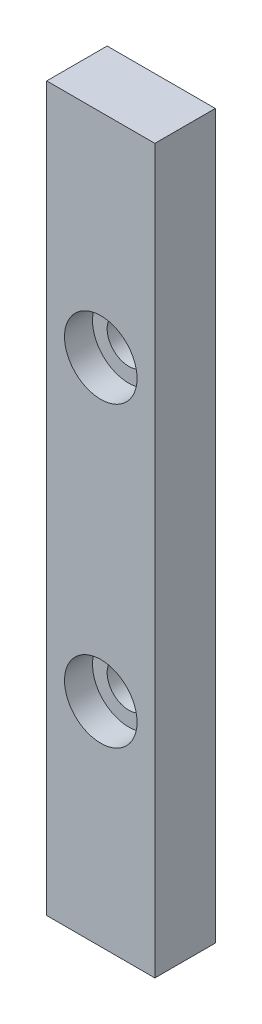
ISO-10303-21;
HEADER;
FILE_DESCRIPTION(('STEP AP214'),'2;1');
FILE_NAME('part.step','',(''),(''),'','','');
FILE_SCHEMA(('AUTOMOTIVE_DESIGN { 1 0 10303 214 1 1 1 1 }'));
ENDSEC;
DATA;
#1=APPLICATION_CONTEXT('core data for automotive mechanical design processes');
#2=APPLICATION_PROTOCOL_DEFINITION('international standard','automotive_design',2000,#1);
#3=PRODUCT_CONTEXT('',#1,'mechanical');
#4=PRODUCT('Part','Part','',(#3));
#5=PRODUCT_RELATED_PRODUCT_CATEGORY('part','',(#4));
#6=PRODUCT_DEFINITION_FORMATION('','',#4);
#7=PRODUCT_DEFINITION_CONTEXT('part definition',#1,'design');
#8=PRODUCT_DEFINITION('design','',#6,#7);
#9=PRODUCT_DEFINITION_SHAPE('','',#8);
#10=(LENGTH_UNIT() NAMED_UNIT(*) SI_UNIT(.MILLI.,.METRE.));
#11=(NAMED_UNIT(*) PLANE_ANGLE_UNIT() SI_UNIT($,.RADIAN.));
#12=(NAMED_UNIT(*) SI_UNIT($,.STERADIAN.) SOLID_ANGLE_UNIT());
#13=UNCERTAINTY_MEASURE_WITH_UNIT(LENGTH_MEASURE(1.E-05),#10,'distance_accuracy_value','');
#14=(GEOMETRIC_REPRESENTATION_CONTEXT(3) GLOBAL_UNCERTAINTY_ASSIGNED_CONTEXT((#13)) GLOBAL_UNIT_ASSIGNED_CONTEXT((#10,
#11,#12)) REPRESENTATION_CONTEXT('',''));
#15=CARTESIAN_POINT('',(0.,0.,0.));
#16=DIRECTION('',(0.,0.,1.));
#17=DIRECTION('',(1.,0.,0.));
#18=AXIS2_PLACEMENT_3D('',#15,#16,#17);
#19=CARTESIAN_POINT('',(4.25,-40.1,4.75));
#20=DIRECTION('',(0.,0.,1.));
#21=DIRECTION('',(1.,0.,0.));
#22=AXIS2_PLACEMENT_3D('',#19,#20,#21);
#23=CYLINDRICAL_SURFACE('',#22,1.69999999999999);
#24=CARTESIAN_POINT('',(4.25,-40.1,0.));
#25=DIRECTION('',(0.,0.,1.));
#26=DIRECTION('',(1.,0.,0.));
#27=AXIS2_PLACEMENT_3D('',#24,#25,#26);
#28=CIRCLE('',#27,1.69999999999999);
#29=CARTESIAN_POINT('',(5.94999999999999,-40.1,0.));
#30=VERTEX_POINT('',#29);
#31=EDGE_CURVE('E106',#30,#30,#28,.T.);
#32=ORIENTED_EDGE('',*,*,#31,.F.);
#33=EDGE_LOOP('',(#32));
#34=FACE_BOUND('',#33,.T.);
#35=CARTESIAN_POINT('',(4.25,-40.1,2.55));
#36=DIRECTION('',(0.,0.,1.));
#37=DIRECTION('',(1.,0.,0.));
#38=AXIS2_PLACEMENT_3D('',#35,#36,#37);
#39=CIRCLE('',#38,1.69999999999999);
#40=CARTESIAN_POINT('',(5.94999999999999,-40.1,2.55));
#41=VERTEX_POINT('',#40);
#42=EDGE_CURVE('E40',#41,#41,#39,.F.);
#43=ORIENTED_EDGE('',*,*,#42,.F.);
#44=EDGE_LOOP('',(#43));
#45=FACE_BOUND('',#44,.T.);
#46=ADVANCED_FACE('F36',(#34,#45),#23,.F.);
#47=CARTESIAN_POINT('',(4.25,-16.7,4.75));
#48=DIRECTION('',(0.,0.,1.));
#49=DIRECTION('',(1.,0.,0.));
#50=AXIS2_PLACEMENT_3D('',#47,#48,#49);
#51=CYLINDRICAL_SURFACE('',#50,1.69999999999999);
#52=CARTESIAN_POINT('',(4.25,-16.7,0.));
#53=DIRECTION('',(0.,0.,1.));
#54=DIRECTION('',(1.,0.,0.));
#55=AXIS2_PLACEMENT_3D('',#52,#53,#54);
#56=CIRCLE('',#55,1.69999999999999);
#57=CARTESIAN_POINT('',(5.94999999999999,-16.7,0.));
#58=VERTEX_POINT('',#57);
#59=EDGE_CURVE('E112',#58,#58,#56,.T.);
#60=ORIENTED_EDGE('',*,*,#59,.F.);
#61=EDGE_LOOP('',(#60));
#62=FACE_BOUND('',#61,.T.);
#63=CARTESIAN_POINT('',(4.25,-16.7,2.55));
#64=DIRECTION('',(0.,0.,1.));
#65=DIRECTION('',(1.,0.,0.));
#66=AXIS2_PLACEMENT_3D('',#63,#64,#65);
#67=CIRCLE('',#66,1.69999999999999);
#68=CARTESIAN_POINT('',(5.94999999999999,-16.7,2.55));
#69=VERTEX_POINT('',#68);
#70=EDGE_CURVE('E114',#69,#69,#67,.F.);
#71=ORIENTED_EDGE('',*,*,#70,.F.);
#72=EDGE_LOOP('',(#71));
#73=FACE_BOUND('',#72,.T.);
#74=ADVANCED_FACE('F142',(#62,#73),#51,.F.);
#75=CARTESIAN_POINT('',(0.,0.,4.75));
#76=DIRECTION('',(1.,0.,0.));
#77=DIRECTION('',(0.,1.,0.));
#78=AXIS2_PLACEMENT_3D('',#75,#76,#77);
#79=PLANE('',#78);
#80=DIRECTION('',(0.,-1.,0.));
#81=VECTOR('',#80,1.);
#82=CARTESIAN_POINT('',(0.,0.,0.));
#83=LINE('',#82,#81);
#84=CARTESIAN_POINT('',(0.,0.,0.));
#85=VERTEX_POINT('',#84);
#86=CARTESIAN_POINT('',(0.,-56.8,0.));
#87=VERTEX_POINT('',#86);
#88=EDGE_CURVE('E103',#85,#87,#83,.T.);
#89=ORIENTED_EDGE('',*,*,#88,.T.);
#90=DIRECTION('',(0.,0.,-1.));
#91=VECTOR('',#90,1.);
#92=CARTESIAN_POINT('',(0.,-56.8,4.75));
#93=LINE('',#92,#91);
#94=CARTESIAN_POINT('',(0.,-56.8,4.75));
#95=VERTEX_POINT('',#94);
#96=EDGE_CURVE('E11',#95,#87,#93,.T.);
#97=ORIENTED_EDGE('',*,*,#96,.F.);
#98=DIRECTION('',(0.,-1.,0.));
#99=VECTOR('',#98,1.);
#100=CARTESIAN_POINT('',(0.,0.,4.75));
#101=LINE('',#100,#99);
#102=CARTESIAN_POINT('',(0.,0.,4.75));
#103=VERTEX_POINT('',#102);
#104=EDGE_CURVE('E90',#103,#95,#101,.T.);
#105=ORIENTED_EDGE('',*,*,#104,.F.);
#106=DIRECTION('',(0.,0.,-1.));
#107=VECTOR('',#106,1.);
#108=CARTESIAN_POINT('',(0.,0.,4.75));
#109=LINE('',#108,#107);
#110=EDGE_CURVE('E99',#103,#85,#109,.T.);
#111=ORIENTED_EDGE('',*,*,#110,.T.);
#112=EDGE_LOOP('',(#89,#97,#105,#111));
#113=FACE_BOUND('',#112,.T.);
#114=ADVANCED_FACE('F38',(#113),#79,.F.);
#115=CARTESIAN_POINT('',(0.,-56.8,4.75));
#116=DIRECTION('',(0.,1.,0.));
#117=DIRECTION('',(0.,0.,1.));
#118=AXIS2_PLACEMENT_3D('',#115,#116,#117);
#119=PLANE('',#118);
#120=DIRECTION('',(1.,0.,0.));
#121=VECTOR('',#120,1.);
#122=CARTESIAN_POINT('',(0.,-56.8,0.));
#123=LINE('',#122,#121);
#124=CARTESIAN_POINT('',(8.50000000000001,-56.8,0.));
#125=VERTEX_POINT('',#124);
#126=EDGE_CURVE('E94',#87,#125,#123,.T.);
#127=ORIENTED_EDGE('',*,*,#126,.T.);
#128=DIRECTION('',(0.,0.,-1.));
#129=VECTOR('',#128,1.);
#130=CARTESIAN_POINT('',(8.50000000000001,-56.8,4.75));
#131=LINE('',#130,#129);
#132=CARTESIAN_POINT('',(8.50000000000001,-56.8,4.75));
#133=VERTEX_POINT('',#132);
#134=EDGE_CURVE('E46',#133,#125,#131,.T.);
#135=ORIENTED_EDGE('',*,*,#134,.F.);
#136=DIRECTION('',(1.,0.,0.));
#137=VECTOR('',#136,1.);
#138=CARTESIAN_POINT('',(0.,-56.8,4.75));
#139=LINE('',#138,#137);
#140=EDGE_CURVE('E85',#95,#133,#139,.T.);
#141=ORIENTED_EDGE('',*,*,#140,.F.);
#142=ORIENTED_EDGE('',*,*,#96,.T.);
#143=EDGE_LOOP('',(#127,#135,#141,#142));
#144=FACE_BOUND('',#143,.T.);
#145=ADVANCED_FACE('F93',(#144),#119,.F.);
#146=CARTESIAN_POINT('',(8.5,0.,4.75));
#147=DIRECTION('',(-1.,0.,0.));
#148=DIRECTION('',(0.,-1.,0.));
#149=AXIS2_PLACEMENT_3D('',#146,#147,#148);
#150=PLANE('',#149);
#151=DIRECTION('',(0.,1.,0.));
#152=VECTOR('',#151,1.);
#153=CARTESIAN_POINT('',(8.5,0.,0.));
#154=LINE('',#153,#152);
#155=CARTESIAN_POINT('',(8.5,0.,0.));
#156=VERTEX_POINT('',#155);
#157=EDGE_CURVE('E72',#125,#156,#154,.T.);
#158=ORIENTED_EDGE('',*,*,#157,.T.);
#159=DIRECTION('',(0.,0.,-1.));
#160=VECTOR('',#159,1.);
#161=CARTESIAN_POINT('',(8.5,0.,4.75));
#162=LINE('',#161,#160);
#163=CARTESIAN_POINT('',(8.5,0.,4.75));
#164=VERTEX_POINT('',#163);
#165=EDGE_CURVE('E95',#164,#156,#162,.T.);
#166=ORIENTED_EDGE('',*,*,#165,.F.);
#167=DIRECTION('',(0.,1.,0.));
#168=VECTOR('',#167,1.);
#169=CARTESIAN_POINT('',(8.5,0.,4.75));
#170=LINE('',#169,#168);
#171=EDGE_CURVE('E88',#133,#164,#170,.T.);
#172=ORIENTED_EDGE('',*,*,#171,.F.);
#173=ORIENTED_EDGE('',*,*,#134,.T.);
#174=EDGE_LOOP('',(#158,#166,#172,#173));
#175=FACE_BOUND('',#174,.T.);
#176=ADVANCED_FACE('F97',(#175),#150,.F.);
#177=CARTESIAN_POINT('',(0.,0.,4.75));
#178=DIRECTION('',(0.,-1.,0.));
#179=DIRECTION('',(0.,0.,-1.));
#180=AXIS2_PLACEMENT_3D('',#177,#178,#179);
#181=PLANE('',#180);
#182=DIRECTION('',(-1.,0.,0.));
#183=VECTOR('',#182,1.);
#184=CARTESIAN_POINT('',(0.,0.,0.));
#185=LINE('',#184,#183);
#186=EDGE_CURVE('E78',#156,#85,#185,.T.);
#187=ORIENTED_EDGE('',*,*,#186,.T.);
#188=ORIENTED_EDGE('',*,*,#110,.F.);
#189=DIRECTION('',(-1.,0.,0.));
#190=VECTOR('',#189,1.);
#191=CARTESIAN_POINT('',(0.,0.,4.75));
#192=LINE('',#191,#190);
#193=EDGE_CURVE('E55',#164,#103,#192,.T.);
#194=ORIENTED_EDGE('',*,*,#193,.F.);
#195=ORIENTED_EDGE('',*,*,#165,.T.);
#196=EDGE_LOOP('',(#187,#188,#194,#195));
#197=FACE_BOUND('',#196,.T.);
#198=ADVANCED_FACE('F168',(#197),#181,.F.);
#199=CARTESIAN_POINT('',(0.,0.,4.75));
#200=DIRECTION('',(0.,0.,1.));
#201=DIRECTION('',(1.,0.,0.));
#202=AXIS2_PLACEMENT_3D('',#199,#200,#201);
#203=PLANE('',#202);
#204=CARTESIAN_POINT('',(4.25,-16.7,4.75));
#205=DIRECTION('',(0.,0.,1.));
#206=DIRECTION('',(1.,0.,0.));
#207=AXIS2_PLACEMENT_3D('',#204,#205,#206);
#208=CIRCLE('',#207,2.85);
#209=CARTESIAN_POINT('',(7.1,-16.7,4.75));
#210=VERTEX_POINT('',#209);
#211=EDGE_CURVE('E121',#210,#210,#208,.T.);
#212=ORIENTED_EDGE('',*,*,#211,.F.);
#213=EDGE_LOOP('',(#212));
#214=FACE_BOUND('',#213,.T.);
#215=CARTESIAN_POINT('',(4.25,-40.1,4.75));
#216=DIRECTION('',(0.,0.,1.));
#217=DIRECTION('',(1.,0.,0.));
#218=AXIS2_PLACEMENT_3D('',#215,#216,#217);
#219=CIRCLE('',#218,2.85);
#220=CARTESIAN_POINT('',(7.1,-40.1,4.75));
#221=VERTEX_POINT('',#220);
#222=EDGE_CURVE('E131',#221,#221,#219,.T.);
#223=ORIENTED_EDGE('',*,*,#222,.F.);
#224=EDGE_LOOP('',(#223));
#225=FACE_BOUND('',#224,.T.);
#226=ORIENTED_EDGE('',*,*,#104,.T.);
#227=ORIENTED_EDGE('',*,*,#140,.T.);
#228=ORIENTED_EDGE('',*,*,#171,.T.);
#229=ORIENTED_EDGE('',*,*,#193,.T.);
#230=EDGE_LOOP('',(#226,#227,#228,#229));
#231=FACE_BOUND('',#230,.T.);
#232=ADVANCED_FACE('F86',(#214,#225,#231),#203,.T.);
#233=CARTESIAN_POINT('',(0.,0.,0.));
#234=DIRECTION('',(0.,0.,1.));
#235=DIRECTION('',(1.,0.,0.));
#236=AXIS2_PLACEMENT_3D('',#233,#234,#235);
#237=PLANE('',#236);
#238=ORIENTED_EDGE('',*,*,#59,.T.);
#239=EDGE_LOOP('',(#238));
#240=FACE_BOUND('',#239,.T.);
#241=ORIENTED_EDGE('',*,*,#31,.T.);
#242=EDGE_LOOP('',(#241));
#243=FACE_BOUND('',#242,.T.);
#244=ORIENTED_EDGE('',*,*,#88,.F.);
#245=ORIENTED_EDGE('',*,*,#186,.F.);
#246=ORIENTED_EDGE('',*,*,#157,.F.);
#247=ORIENTED_EDGE('',*,*,#126,.F.);
#248=EDGE_LOOP('',(#244,#245,#246,#247));
#249=FACE_BOUND('',#248,.T.);
#250=ADVANCED_FACE('F137',(#240,#243,#249),#237,.F.);
#251=CARTESIAN_POINT('',(4.25,-16.7,2.55));
#252=DIRECTION('',(0.,0.,1.));
#253=DIRECTION('',(1.,0.,0.));
#254=AXIS2_PLACEMENT_3D('',#251,#252,#253);
#255=PLANE('',#254);
#256=CARTESIAN_POINT('',(4.25,-16.7,2.55));
#257=DIRECTION('',(0.,0.,1.));
#258=DIRECTION('',(1.,0.,0.));
#259=AXIS2_PLACEMENT_3D('',#256,#257,#258);
#260=CIRCLE('',#259,2.85);
#261=CARTESIAN_POINT('',(7.1,-16.7,2.55));
#262=VERTEX_POINT('',#261);
#263=EDGE_CURVE('E116',#262,#262,#260,.T.);
#264=ORIENTED_EDGE('',*,*,#263,.T.);
#265=EDGE_LOOP('',(#264));
#266=FACE_BOUND('',#265,.T.);
#267=ORIENTED_EDGE('',*,*,#70,.T.);
#268=EDGE_LOOP('',(#267));
#269=FACE_BOUND('',#268,.T.);
#270=ADVANCED_FACE('F158',(#266,#269),#255,.T.);
#271=CARTESIAN_POINT('',(4.25,-16.7,2.55));
#272=DIRECTION('',(0.,0.,1.));
#273=DIRECTION('',(1.,0.,0.));
#274=AXIS2_PLACEMENT_3D('',#271,#272,#273);
#275=CYLINDRICAL_SURFACE('',#274,2.85);
#276=ORIENTED_EDGE('',*,*,#263,.F.);
#277=EDGE_LOOP('',(#276));
#278=FACE_BOUND('',#277,.T.);
#279=ORIENTED_EDGE('',*,*,#211,.T.);
#280=EDGE_LOOP('',(#279));
#281=FACE_BOUND('',#280,.T.);
#282=ADVANCED_FACE('F149',(#278,#281),#275,.F.);
#283=CARTESIAN_POINT('',(4.25,-40.1,2.55));
#284=DIRECTION('',(0.,0.,1.));
#285=DIRECTION('',(1.,0.,0.));
#286=AXIS2_PLACEMENT_3D('',#283,#284,#285);
#287=PLANE('',#286);
#288=CARTESIAN_POINT('',(4.25,-40.1,2.55));
#289=DIRECTION('',(0.,0.,1.));
#290=DIRECTION('',(1.,0.,0.));
#291=AXIS2_PLACEMENT_3D('',#288,#289,#290);
#292=CIRCLE('',#291,2.85);
#293=CARTESIAN_POINT('',(7.1,-40.1,2.55));
#294=VERTEX_POINT('',#293);
#295=EDGE_CURVE('E126',#294,#294,#292,.T.);
#296=ORIENTED_EDGE('',*,*,#295,.T.);
#297=EDGE_LOOP('',(#296));
#298=FACE_BOUND('',#297,.T.);
#299=ORIENTED_EDGE('',*,*,#42,.T.);
#300=EDGE_LOOP('',(#299));
#301=FACE_BOUND('',#300,.T.);
#302=ADVANCED_FACE('F146',(#298,#301),#287,.T.);
#303=CARTESIAN_POINT('',(4.25,-40.1,2.55));
#304=DIRECTION('',(0.,0.,1.));
#305=DIRECTION('',(1.,0.,0.));
#306=AXIS2_PLACEMENT_3D('',#303,#304,#305);
#307=CYLINDRICAL_SURFACE('',#306,2.85);
#308=ORIENTED_EDGE('',*,*,#295,.F.);
#309=EDGE_LOOP('',(#308));
#310=FACE_BOUND('',#309,.T.);
#311=ORIENTED_EDGE('',*,*,#222,.T.);
#312=EDGE_LOOP('',(#311));
#313=FACE_BOUND('',#312,.T.);
#314=ADVANCED_FACE('F148',(#310,#313),#307,.F.);
#315=CLOSED_SHELL('',(#46,#74,#114,#145,#176,#198,#232,#250,#270,#282,#302,#314));
#316=MANIFOLD_SOLID_BREP('B2',#315);
#317=ADVANCED_BREP_SHAPE_REPRESENTATION('',(#18,#316),#14);
#318=SHAPE_DEFINITION_REPRESENTATION(#9,#317);
ENDSEC;
END-ISO-10303-21;
